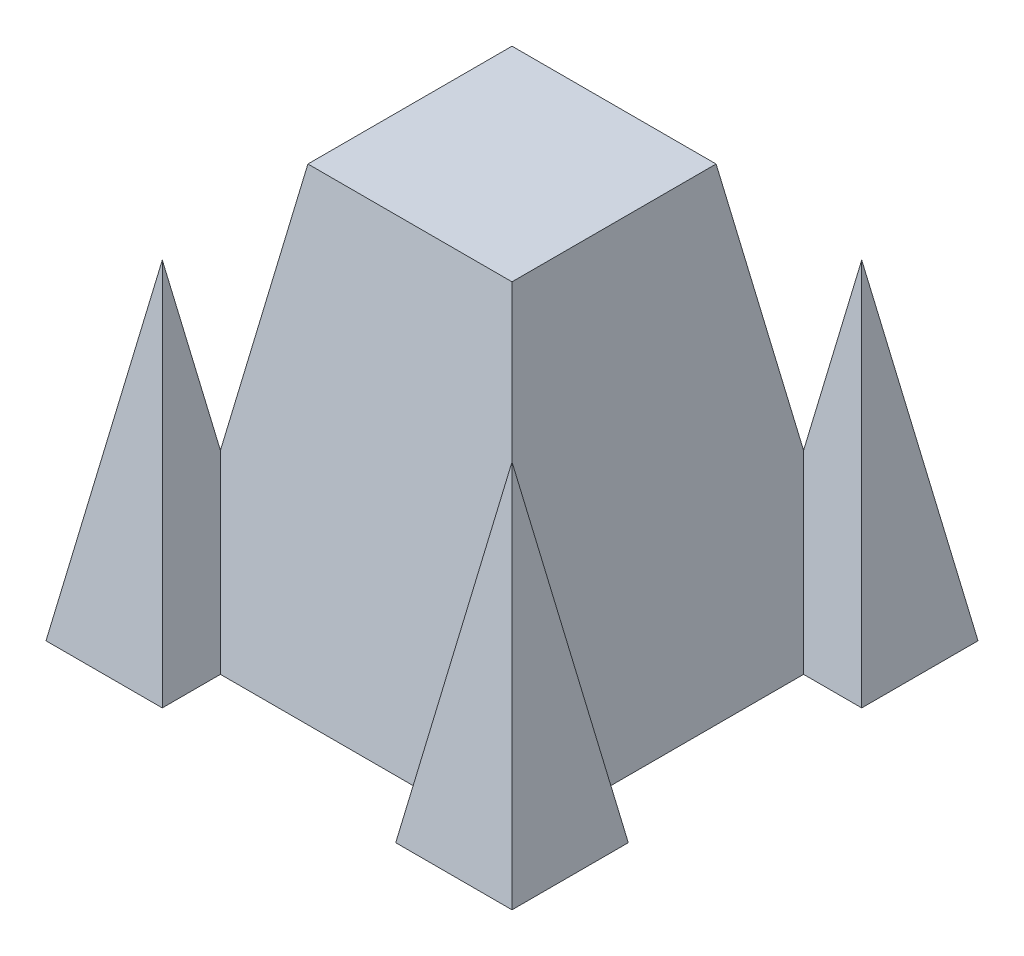
ISO-10303-21;
HEADER;
FILE_DESCRIPTION(('STEP AP214'),'2;1');
FILE_NAME('part.step','',(''),(''),'','','');
FILE_SCHEMA(('AUTOMOTIVE_DESIGN { 1 0 10303 214 1 1 1 1 }'));
ENDSEC;
DATA;
#1=APPLICATION_CONTEXT('core data for automotive mechanical design processes');
#2=APPLICATION_PROTOCOL_DEFINITION('international standard','automotive_design',2000,#1);
#3=PRODUCT_CONTEXT('',#1,'mechanical');
#4=PRODUCT('Part','Part','',(#3));
#5=PRODUCT_RELATED_PRODUCT_CATEGORY('part','',(#4));
#6=PRODUCT_DEFINITION_FORMATION('','',#4);
#7=PRODUCT_DEFINITION_CONTEXT('part definition',#1,'design');
#8=PRODUCT_DEFINITION('design','',#6,#7);
#9=PRODUCT_DEFINITION_SHAPE('','',#8);
#10=(LENGTH_UNIT() NAMED_UNIT(*) SI_UNIT(.MILLI.,.METRE.));
#11=(NAMED_UNIT(*) PLANE_ANGLE_UNIT() SI_UNIT($,.RADIAN.));
#12=(NAMED_UNIT(*) SI_UNIT($,.STERADIAN.) SOLID_ANGLE_UNIT());
#13=UNCERTAINTY_MEASURE_WITH_UNIT(LENGTH_MEASURE(1.E-05),#10,'distance_accuracy_value','');
#14=(GEOMETRIC_REPRESENTATION_CONTEXT(3) GLOBAL_UNCERTAINTY_ASSIGNED_CONTEXT((#13)) GLOBAL_UNIT_ASSIGNED_CONTEXT((#10,
#11,#12)) REPRESENTATION_CONTEXT('',''));
#15=CARTESIAN_POINT('',(0.,0.,0.));
#16=DIRECTION('',(0.,0.,1.));
#17=DIRECTION('',(1.,0.,0.));
#18=AXIS2_PLACEMENT_3D('',#15,#16,#17);
#19=CARTESIAN_POINT('',(29.6786730722033,0.,59.2470630383818));
#20=DIRECTION('',(-0.984807753012208,0.173648177666931,0.));
#21=DIRECTION('',(-0.173648177666931,-0.984807753012208,0.));
#22=AXIS2_PLACEMENT_3D('',#19,#20,#21);
#23=PLANE('',#22);
#24=DIRECTION('',(-0.171087869746036,-0.970287525247814,0.171087869746036));
#25=VECTOR('',#24,1.);
#26=CARTESIAN_POINT('',(30.5441711645902,4.90848359626769,58.3815649459949));
#27=LINE('',#26,#25);
#28=CARTESIAN_POINT('',(44.4628680552925,83.8453362252772,44.4628680552926));
#29=VERTEX_POINT('',#28);
#30=CARTESIAN_POINT('',(29.6786730722033,0.,59.2470630383818));
#31=VERTEX_POINT('',#30);
#32=EDGE_CURVE('E257',#29,#31,#27,.T.);
#33=ORIENTED_EDGE('',*,*,#32,.F.);
#34=DIRECTION('',(-0.171087869746036,-0.970287525247814,-0.171087869746036));
#35=VECTOR('',#34,1.);
#36=CARTESIAN_POINT('',(30.5441711645902,4.9084835962677,30.5441711645902));
#37=LINE('',#36,#35);
#38=CARTESIAN_POINT('',(37.0707705637479,41.9226681126385,37.0707705637479));
#39=VERTEX_POINT('',#38);
#40=EDGE_CURVE('E325',#29,#39,#37,.T.);
#41=ORIENTED_EDGE('',*,*,#40,.T.);
#42=DIRECTION('',(-0.171087869746036,-0.970287525247814,0.171087869746036));
#43=VECTOR('',#42,1.);
#44=CARTESIAN_POINT('',(27.9412206807847,-9.8535821599034,46.2003204467111));
#45=LINE('',#44,#43);
#46=CARTESIAN_POINT('',(29.6786730722033,0.,44.4628680552925));
#47=VERTEX_POINT('',#46);
#48=EDGE_CURVE('E261',#39,#47,#45,.T.);
#49=ORIENTED_EDGE('',*,*,#48,.T.);
#50=DIRECTION('',(0.,0.,1.));
#51=VECTOR('',#50,1.);
#52=CARTESIAN_POINT('',(29.6786730722033,0.,59.2470630383818));
#53=LINE('',#52,#51);
#54=EDGE_CURVE('E199',#47,#31,#53,.T.);
#55=ORIENTED_EDGE('',*,*,#54,.T.);
#56=EDGE_LOOP('',(#33,#41,#49,#55));
#57=FACE_BOUND('',#56,.T.);
#58=ADVANCED_FACE('F33',(#57),#23,.T.);
#59=CARTESIAN_POINT('',(59.2470630383818,0.,59.2470630383818));
#60=DIRECTION('',(0.,0.173648177666931,0.984807753012208));
#61=DIRECTION('',(0.,-0.984807753012208,0.173648177666931));
#62=AXIS2_PLACEMENT_3D('',#59,#60,#61);
#63=PLANE('',#62);
#64=DIRECTION('',(1.,0.,0.));
#65=VECTOR('',#64,1.);
#66=CARTESIAN_POINT('',(59.2470630383818,0.,59.2470630383818));
#67=LINE('',#66,#65);
#68=CARTESIAN_POINT('',(59.2470630383818,0.,59.2470630383818));
#69=VERTEX_POINT('',#68);
#70=EDGE_CURVE('E202',#31,#69,#67,.T.);
#71=ORIENTED_EDGE('',*,*,#70,.T.);
#72=DIRECTION('',(0.171087869746036,-0.970287525247814,0.171087869746036));
#73=VECTOR('',#72,1.);
#74=CARTESIAN_POINT('',(59.2470630383818,0.,59.2470630383818));
#75=LINE('',#74,#73);
#76=EDGE_CURVE('E260',#29,#69,#75,.T.);
#77=ORIENTED_EDGE('',*,*,#76,.F.);
#78=ORIENTED_EDGE('',*,*,#32,.T.);
#79=EDGE_LOOP('',(#71,#77,#78));
#80=FACE_BOUND('',#79,.T.);
#81=ADVANCED_FACE('F35',(#80),#63,.T.);
#82=CARTESIAN_POINT('',(59.2470630383818,0.,59.2470630383818));
#83=DIRECTION('',(0.984807753012208,0.173648177666931,0.));
#84=DIRECTION('',(-0.173648177666931,0.984807753012208,0.));
#85=AXIS2_PLACEMENT_3D('',#82,#83,#84);
#86=PLANE('',#85);
#87=DIRECTION('',(0.,0.,-1.));
#88=VECTOR('',#87,1.);
#89=CARTESIAN_POINT('',(59.2470630383818,0.,59.2470630383818));
#90=LINE('',#89,#88);
#91=CARTESIAN_POINT('',(59.2470630383818,0.,29.6786730722033));
#92=VERTEX_POINT('',#91);
#93=EDGE_CURVE('E205',#69,#92,#90,.T.);
#94=ORIENTED_EDGE('',*,*,#93,.T.);
#95=DIRECTION('',(0.171087869746036,-0.970287525247814,-0.171087869746036));
#96=VECTOR('',#95,1.);
#97=CARTESIAN_POINT('',(59.2470630383818,0.,29.6786730722033));
#98=LINE('',#97,#96);
#99=EDGE_CURVE('E299',#29,#92,#98,.T.);
#100=ORIENTED_EDGE('',*,*,#99,.F.);
#101=ORIENTED_EDGE('',*,*,#76,.T.);
#102=EDGE_LOOP('',(#94,#100,#101));
#103=FACE_BOUND('',#102,.T.);
#104=ADVANCED_FACE('F409',(#103),#86,.T.);
#105=CARTESIAN_POINT('',(59.2470630383818,0.,29.6786730722033));
#106=DIRECTION('',(0.,0.173648177666931,-0.984807753012208));
#107=DIRECTION('',(0.,0.984807753012208,0.173648177666931));
#108=AXIS2_PLACEMENT_3D('',#105,#106,#107);
#109=PLANE('',#108);
#110=ORIENTED_EDGE('',*,*,#40,.F.);
#111=ORIENTED_EDGE('',*,*,#99,.T.);
#112=DIRECTION('',(-1.,0.,0.));
#113=VECTOR('',#112,1.);
#114=CARTESIAN_POINT('',(59.2470630383818,0.,29.6786730722033));
#115=LINE('',#114,#113);
#116=CARTESIAN_POINT('',(44.4628680552925,0.,29.6786730722033));
#117=VERTEX_POINT('',#116);
#118=EDGE_CURVE('E207',#92,#117,#115,.T.);
#119=ORIENTED_EDGE('',*,*,#118,.T.);
#120=DIRECTION('',(0.171087869746036,-0.970287525247814,-0.171087869746036));
#121=VECTOR('',#120,1.);
#122=CARTESIAN_POINT('',(44.895617101486,-2.45424179813385,29.2459240260098));
#123=LINE('',#122,#121);
#124=EDGE_CURVE('E297',#39,#117,#123,.T.);
#125=ORIENTED_EDGE('',*,*,#124,.F.);
#126=EDGE_LOOP('',(#110,#111,#119,#125));
#127=FACE_BOUND('',#126,.T.);
#128=ADVANCED_FACE('F404',(#127),#109,.T.);
#129=CARTESIAN_POINT('',(44.4628680552925,0.,-29.6786730722032));
#130=DIRECTION('',(0.984807753012208,0.173648177666931,0.));
#131=DIRECTION('',(-0.173648177666931,0.984807753012208,0.));
#132=AXIS2_PLACEMENT_3D('',#129,#130,#131);
#133=PLANE('',#132);
#134=DIRECTION('',(0.,0.,1.));
#135=VECTOR('',#134,1.);
#136=CARTESIAN_POINT('',(25.9485350809036,105.,0.));
#137=LINE('',#136,#135);
#138=CARTESIAN_POINT('',(25.9485350809036,105.,25.9485350809037));
#139=VERTEX_POINT('',#138);
#140=CARTESIAN_POINT('',(25.9485350809036,105.,-25.9485350809037));
#141=VERTEX_POINT('',#140);
#142=EDGE_CURVE('E256',#139,#141,#137,.F.);
#143=ORIENTED_EDGE('',*,*,#142,.F.);
#144=DIRECTION('',(0.171087869746036,-0.970287525247814,0.171087869746036));
#145=VECTOR('',#144,1.);
#146=CARTESIAN_POINT('',(42.2926666176805,12.3078239580372,42.2926666176805));
#147=LINE('',#146,#145);
#148=EDGE_CURVE('E315',#139,#39,#147,.T.);
#149=ORIENTED_EDGE('',*,*,#148,.T.);
#150=ORIENTED_EDGE('',*,*,#124,.T.);
#151=DIRECTION('',(0.,0.,-1.));
#152=VECTOR('',#151,1.);
#153=CARTESIAN_POINT('',(44.4628680552925,0.,-29.6786730722032));
#154=LINE('',#153,#152);
#155=CARTESIAN_POINT('',(44.4628680552925,0.,-29.6786730722032));
#156=VERTEX_POINT('',#155);
#157=EDGE_CURVE('E210',#117,#156,#154,.T.);
#158=ORIENTED_EDGE('',*,*,#157,.T.);
#159=DIRECTION('',(0.171087869746036,-0.970287525247814,0.171087869746036));
#160=VECTOR('',#159,1.);
#161=CARTESIAN_POINT('',(44.4628680552925,0.,-29.6786730722032));
#162=LINE('',#161,#160);
#163=CARTESIAN_POINT('',(37.0707705637479,41.9226681126386,-37.0707705637479));
#164=VERTEX_POINT('',#163);
#165=EDGE_CURVE('E295',#164,#156,#162,.T.);
#166=ORIENTED_EDGE('',*,*,#165,.F.);
#167=DIRECTION('',(0.171087869746036,-0.970287525247814,-0.171087869746036));
#168=VECTOR('',#167,1.);
#169=CARTESIAN_POINT('',(42.2926666176805,12.3078239580372,-42.2926666176805));
#170=LINE('',#169,#168);
#171=EDGE_CURVE('E259',#141,#164,#170,.T.);
#172=ORIENTED_EDGE('',*,*,#171,.F.);
#173=EDGE_LOOP('',(#143,#149,#150,#158,#166,#172));
#174=FACE_BOUND('',#173,.T.);
#175=ADVANCED_FACE('F401',(#174),#133,.T.);
#176=CARTESIAN_POINT('',(59.2470630383817,0.,-29.6786730722032));
#177=DIRECTION('',(0.,0.173648177666931,0.984807753012208));
#178=DIRECTION('',(0.,-0.984807753012208,0.173648177666931));
#179=AXIS2_PLACEMENT_3D('',#176,#177,#178);
#180=PLANE('',#179);
#181=DIRECTION('',(0.171087869746036,-0.970287525247814,0.171087869746036));
#182=VECTOR('',#181,1.);
#183=CARTESIAN_POINT('',(58.3815649459948,4.90848359626769,-30.5441711645901));
#184=LINE('',#183,#182);
#185=CARTESIAN_POINT('',(44.4628680552925,83.8453362252771,-44.4628680552924));
#186=VERTEX_POINT('',#185);
#187=CARTESIAN_POINT('',(59.2470630383817,0.,-29.6786730722032));
#188=VERTEX_POINT('',#187);
#189=EDGE_CURVE('E293',#186,#188,#184,.T.);
#190=ORIENTED_EDGE('',*,*,#189,.F.);
#191=DIRECTION('',(-0.171087869746036,-0.970287525247814,0.171087869746036));
#192=VECTOR('',#191,1.);
#193=CARTESIAN_POINT('',(30.5441711645902,4.90848359626769,-30.5441711645901));
#194=LINE('',#193,#192);
#195=EDGE_CURVE('E323',#186,#164,#194,.T.);
#196=ORIENTED_EDGE('',*,*,#195,.T.);
#197=ORIENTED_EDGE('',*,*,#165,.T.);
#198=DIRECTION('',(1.,0.,0.));
#199=VECTOR('',#198,1.);
#200=CARTESIAN_POINT('',(59.2470630383817,0.,-29.6786730722032));
#201=LINE('',#200,#199);
#202=EDGE_CURVE('E213',#156,#188,#201,.T.);
#203=ORIENTED_EDGE('',*,*,#202,.T.);
#204=EDGE_LOOP('',(#190,#196,#197,#203));
#205=FACE_BOUND('',#204,.T.);
#206=ADVANCED_FACE('F398',(#205),#180,.T.);
#207=CARTESIAN_POINT('',(59.2470630383817,0.,-59.2470630383817));
#208=DIRECTION('',(0.984807753012208,0.173648177666931,0.));
#209=DIRECTION('',(-0.173648177666931,0.984807753012208,0.));
#210=AXIS2_PLACEMENT_3D('',#207,#208,#209);
#211=PLANE('',#210);
#212=DIRECTION('',(0.,0.,-1.));
#213=VECTOR('',#212,1.);
#214=CARTESIAN_POINT('',(59.2470630383817,0.,-59.2470630383817));
#215=LINE('',#214,#213);
#216=CARTESIAN_POINT('',(59.2470630383817,0.,-59.2470630383817));
#217=VERTEX_POINT('',#216);
#218=EDGE_CURVE('E216',#188,#217,#215,.T.);
#219=ORIENTED_EDGE('',*,*,#218,.T.);
#220=DIRECTION('',(0.171087869746036,-0.970287525247814,-0.171087869746036));
#221=VECTOR('',#220,1.);
#222=CARTESIAN_POINT('',(59.2470630383817,0.,-59.2470630383817));
#223=LINE('',#222,#221);
#224=EDGE_CURVE('E291',#186,#217,#223,.T.);
#225=ORIENTED_EDGE('',*,*,#224,.F.);
#226=ORIENTED_EDGE('',*,*,#189,.T.);
#227=EDGE_LOOP('',(#219,#225,#226));
#228=FACE_BOUND('',#227,.T.);
#229=ADVANCED_FACE('F393',(#228),#211,.T.);
#230=CARTESIAN_POINT('',(59.2470630383817,0.,-59.2470630383817));
#231=DIRECTION('',(0.,0.173648177666931,-0.984807753012208));
#232=DIRECTION('',(0.,0.984807753012208,0.173648177666931));
#233=AXIS2_PLACEMENT_3D('',#230,#231,#232);
#234=PLANE('',#233);
#235=DIRECTION('',(-1.,0.,0.));
#236=VECTOR('',#235,1.);
#237=CARTESIAN_POINT('',(59.2470630383817,0.,-59.2470630383817));
#238=LINE('',#237,#236);
#239=CARTESIAN_POINT('',(29.6786730722032,0.,-59.2470630383817));
#240=VERTEX_POINT('',#239);
#241=EDGE_CURVE('E219',#217,#240,#238,.T.);
#242=ORIENTED_EDGE('',*,*,#241,.T.);
#243=DIRECTION('',(-0.171087869746036,-0.970287525247814,-0.171087869746036));
#244=VECTOR('',#243,1.);
#245=CARTESIAN_POINT('',(29.6786730722032,0.,-59.2470630383817));
#246=LINE('',#245,#244);
#247=EDGE_CURVE('E288',#186,#240,#246,.T.);
#248=ORIENTED_EDGE('',*,*,#247,.F.);
#249=ORIENTED_EDGE('',*,*,#224,.T.);
#250=EDGE_LOOP('',(#242,#248,#249));
#251=FACE_BOUND('',#250,.T.);
#252=ADVANCED_FACE('F390',(#251),#234,.T.);
#253=CARTESIAN_POINT('',(29.6786730722032,0.,-59.2470630383817));
#254=DIRECTION('',(-0.984807753012208,0.173648177666931,0.));
#255=DIRECTION('',(-0.173648177666931,-0.984807753012208,0.));
#256=AXIS2_PLACEMENT_3D('',#253,#254,#255);
#257=PLANE('',#256);
#258=ORIENTED_EDGE('',*,*,#195,.F.);
#259=ORIENTED_EDGE('',*,*,#247,.T.);
#260=DIRECTION('',(0.,0.,1.));
#261=VECTOR('',#260,1.);
#262=CARTESIAN_POINT('',(29.6786730722032,0.,-59.2470630383817));
#263=LINE('',#262,#261);
#264=CARTESIAN_POINT('',(29.6786730722032,0.,-44.4628680552925));
#265=VERTEX_POINT('',#264);
#266=EDGE_CURVE('E221',#240,#265,#263,.T.);
#267=ORIENTED_EDGE('',*,*,#266,.T.);
#268=DIRECTION('',(-0.171087869746036,-0.970287525247814,-0.171087869746036));
#269=VECTOR('',#268,1.);
#270=CARTESIAN_POINT('',(29.2459240260098,-2.45424179813383,-44.895617101486));
#271=LINE('',#270,#269);
#272=EDGE_CURVE('E286',#164,#265,#271,.T.);
#273=ORIENTED_EDGE('',*,*,#272,.F.);
#274=EDGE_LOOP('',(#258,#259,#267,#273));
#275=FACE_BOUND('',#274,.T.);
#276=ADVANCED_FACE('F386',(#275),#257,.T.);
#277=CARTESIAN_POINT('',(-29.6786730722033,0.,-44.4628680552925));
#278=DIRECTION('',(0.,0.173648177666931,-0.984807753012208));
#279=DIRECTION('',(0.,0.984807753012208,0.173648177666931));
#280=AXIS2_PLACEMENT_3D('',#277,#278,#279);
#281=PLANE('',#280);
#282=DIRECTION('',(-0.171087869746036,-0.970287525247814,-0.171087869746036));
#283=VECTOR('',#282,1.);
#284=CARTESIAN_POINT('',(-44.0301190090991,2.45424179813385,-44.0301190090991));
#285=LINE('',#284,#283);
#286=CARTESIAN_POINT('',(-25.9485350809036,105.,-25.9485350809037));
#287=VERTEX_POINT('',#286);
#288=CARTESIAN_POINT('',(-37.0707705637479,41.9226681126386,-37.0707705637479));
#289=VERTEX_POINT('',#288);
#290=EDGE_CURVE('E318',#287,#289,#285,.T.);
#291=ORIENTED_EDGE('',*,*,#290,.F.);
#292=DIRECTION('',(1.,0.,0.));
#293=VECTOR('',#292,1.);
#294=CARTESIAN_POINT('',(0.,105.,-25.9485350809037));
#295=LINE('',#294,#293);
#296=EDGE_CURVE('E305',#141,#287,#295,.F.);
#297=ORIENTED_EDGE('',*,*,#296,.F.);
#298=ORIENTED_EDGE('',*,*,#171,.T.);
#299=ORIENTED_EDGE('',*,*,#272,.T.);
#300=DIRECTION('',(-1.,0.,0.));
#301=VECTOR('',#300,1.);
#302=CARTESIAN_POINT('',(-29.6786730722033,0.,-44.4628680552925));
#303=LINE('',#302,#301);
#304=CARTESIAN_POINT('',(-29.6786730722033,0.,-44.4628680552925));
#305=VERTEX_POINT('',#304);
#306=EDGE_CURVE('E224',#265,#305,#303,.T.);
#307=ORIENTED_EDGE('',*,*,#306,.T.);
#308=DIRECTION('',(0.171087869746036,-0.970287525247814,-0.171087869746036));
#309=VECTOR('',#308,1.);
#310=CARTESIAN_POINT('',(-29.6786730722033,0.,-44.4628680552925));
#311=LINE('',#310,#309);
#312=EDGE_CURVE('E284',#289,#305,#311,.T.);
#313=ORIENTED_EDGE('',*,*,#312,.F.);
#314=EDGE_LOOP('',(#291,#297,#298,#299,#307,#313));
#315=FACE_BOUND('',#314,.T.);
#316=ADVANCED_FACE('F363',(#315),#281,.T.);
#317=CARTESIAN_POINT('',(-29.6786730722033,0.,-59.2470630383818));
#318=DIRECTION('',(0.984807753012208,0.173648177666931,0.));
#319=DIRECTION('',(-0.173648177666931,0.984807753012208,0.));
#320=AXIS2_PLACEMENT_3D('',#317,#318,#319);
#321=PLANE('',#320);
#322=DIRECTION('',(0.171087869746036,-0.970287525247814,-0.171087869746036));
#323=VECTOR('',#322,1.);
#324=CARTESIAN_POINT('',(-30.5441711645902,4.90848359626769,-58.3815649459949));
#325=LINE('',#324,#323);
#326=CARTESIAN_POINT('',(-44.4628680552925,83.8453362252771,-44.4628680552925));
#327=VERTEX_POINT('',#326);
#328=CARTESIAN_POINT('',(-29.6786730722033,0.,-59.2470630383818));
#329=VERTEX_POINT('',#328);
#330=EDGE_CURVE('E282',#327,#329,#325,.T.);
#331=ORIENTED_EDGE('',*,*,#330,.F.);
#332=DIRECTION('',(0.171087869746036,-0.970287525247814,0.171087869746036));
#333=VECTOR('',#332,1.);
#334=CARTESIAN_POINT('',(-30.5441711645902,4.90848359626769,-30.5441711645902));
#335=LINE('',#334,#333);
#336=EDGE_CURVE('E327',#327,#289,#335,.T.);
#337=ORIENTED_EDGE('',*,*,#336,.T.);
#338=ORIENTED_EDGE('',*,*,#312,.T.);
#339=DIRECTION('',(0.,0.,-1.));
#340=VECTOR('',#339,1.);
#341=CARTESIAN_POINT('',(-29.6786730722033,0.,-59.2470630383818));
#342=LINE('',#341,#340);
#343=EDGE_CURVE('E227',#305,#329,#342,.T.);
#344=ORIENTED_EDGE('',*,*,#343,.T.);
#345=EDGE_LOOP('',(#331,#337,#338,#344));
#346=FACE_BOUND('',#345,.T.);
#347=ADVANCED_FACE('F380',(#346),#321,.T.);
#348=CARTESIAN_POINT('',(-59.2470630383818,0.,-59.2470630383818));
#349=DIRECTION('',(0.,0.173648177666931,-0.984807753012208));
#350=DIRECTION('',(0.,0.984807753012208,0.173648177666931));
#351=AXIS2_PLACEMENT_3D('',#348,#349,#350);
#352=PLANE('',#351);
#353=DIRECTION('',(-1.,0.,0.));
#354=VECTOR('',#353,1.);
#355=CARTESIAN_POINT('',(-59.2470630383818,0.,-59.2470630383818));
#356=LINE('',#355,#354);
#357=CARTESIAN_POINT('',(-59.2470630383818,0.,-59.2470630383818));
#358=VERTEX_POINT('',#357);
#359=EDGE_CURVE('E230',#329,#358,#356,.T.);
#360=ORIENTED_EDGE('',*,*,#359,.T.);
#361=DIRECTION('',(-0.171087869746036,-0.970287525247814,-0.171087869746036));
#362=VECTOR('',#361,1.);
#363=CARTESIAN_POINT('',(-59.2470630383818,0.,-59.2470630383818));
#364=LINE('',#363,#362);
#365=EDGE_CURVE('E280',#327,#358,#364,.T.);
#366=ORIENTED_EDGE('',*,*,#365,.F.);
#367=ORIENTED_EDGE('',*,*,#330,.T.);
#368=EDGE_LOOP('',(#360,#366,#367));
#369=FACE_BOUND('',#368,.T.);
#370=ADVANCED_FACE('F379',(#369),#352,.T.);
#371=CARTESIAN_POINT('',(-59.2470630383818,0.,-59.2470630383818));
#372=DIRECTION('',(-0.984807753012208,0.173648177666931,0.));
#373=DIRECTION('',(-0.173648177666931,-0.984807753012208,0.));
#374=AXIS2_PLACEMENT_3D('',#371,#372,#373);
#375=PLANE('',#374);
#376=DIRECTION('',(0.,0.,1.));
#377=VECTOR('',#376,1.);
#378=CARTESIAN_POINT('',(-59.2470630383818,0.,-59.2470630383818));
#379=LINE('',#378,#377);
#380=CARTESIAN_POINT('',(-59.2470630383818,0.,-29.6786730722033));
#381=VERTEX_POINT('',#380);
#382=EDGE_CURVE('E233',#358,#381,#379,.T.);
#383=ORIENTED_EDGE('',*,*,#382,.T.);
#384=DIRECTION('',(-0.171087869746036,-0.970287525247814,0.171087869746036));
#385=VECTOR('',#384,1.);
#386=CARTESIAN_POINT('',(-59.2470630383818,0.,-29.6786730722033));
#387=LINE('',#386,#385);
#388=EDGE_CURVE('E277',#327,#381,#387,.T.);
#389=ORIENTED_EDGE('',*,*,#388,.F.);
#390=ORIENTED_EDGE('',*,*,#365,.T.);
#391=EDGE_LOOP('',(#383,#389,#390));
#392=FACE_BOUND('',#391,.T.);
#393=ADVANCED_FACE('F376',(#392),#375,.T.);
#394=CARTESIAN_POINT('',(-59.2470630383818,0.,-29.6786730722033));
#395=DIRECTION('',(0.,0.173648177666931,0.984807753012208));
#396=DIRECTION('',(0.,-0.984807753012208,0.173648177666931));
#397=AXIS2_PLACEMENT_3D('',#394,#395,#396);
#398=PLANE('',#397);
#399=ORIENTED_EDGE('',*,*,#336,.F.);
#400=ORIENTED_EDGE('',*,*,#388,.T.);
#401=DIRECTION('',(1.,0.,0.));
#402=VECTOR('',#401,1.);
#403=CARTESIAN_POINT('',(-59.2470630383818,0.,-29.6786730722033));
#404=LINE('',#403,#402);
#405=CARTESIAN_POINT('',(-44.4628680552925,0.,-29.6786730722033));
#406=VERTEX_POINT('',#405);
#407=EDGE_CURVE('E235',#381,#406,#404,.T.);
#408=ORIENTED_EDGE('',*,*,#407,.T.);
#409=DIRECTION('',(-0.171087869746036,-0.970287525247814,0.171087869746036));
#410=VECTOR('',#409,1.);
#411=CARTESIAN_POINT('',(-44.895617101486,-2.45424179813384,-29.2459240260098));
#412=LINE('',#411,#410);
#413=EDGE_CURVE('E275',#289,#406,#412,.T.);
#414=ORIENTED_EDGE('',*,*,#413,.F.);
#415=EDGE_LOOP('',(#399,#400,#408,#414));
#416=FACE_BOUND('',#415,.T.);
#417=ADVANCED_FACE('F368',(#416),#398,.T.);
#418=CARTESIAN_POINT('',(-44.4628680552925,0.,-29.6786730722033));
#419=DIRECTION('',(-0.984807753012208,0.173648177666931,0.));
#420=DIRECTION('',(-0.173648177666931,-0.984807753012208,0.));
#421=AXIS2_PLACEMENT_3D('',#418,#419,#420);
#422=PLANE('',#421);
#423=DIRECTION('',(0.,0.,1.));
#424=VECTOR('',#423,1.);
#425=CARTESIAN_POINT('',(-44.4628680552925,0.,-29.6786730722033));
#426=LINE('',#425,#424);
#427=CARTESIAN_POINT('',(-44.4628680552925,0.,-12.3414810434325));
#428=VERTEX_POINT('',#427);
#429=EDGE_CURVE('E239',#406,#428,#426,.T.);
#430=ORIENTED_EDGE('',*,*,#429,.T.);
#431=DIRECTION('',(-0.173648177666931,-0.984807753012208,0.));
#432=VECTOR('',#431,1.);
#433=CARTESIAN_POINT('',(-44.4628680552925,0.,-12.3414810434325));
#434=LINE('',#433,#432);
#435=CARTESIAN_POINT('',(-38.4105565367998,34.3243642814902,-12.3414810434325));
#436=VERTEX_POINT('',#435);
#437=EDGE_CURVE('E197',#428,#436,#434,.F.);
#438=ORIENTED_EDGE('',*,*,#437,.T.);
#439=DIRECTION('',(0.,0.,-1.));
#440=VECTOR('',#439,1.);
#441=CARTESIAN_POINT('',(-38.4105565367998,34.3243642814902,-29.6786730722033));
#442=LINE('',#441,#440);
#443=CARTESIAN_POINT('',(-38.4105565367998,34.3243642814902,12.3414810434326));
#444=VERTEX_POINT('',#443);
#445=EDGE_CURVE('E11',#436,#444,#442,.F.);
#446=ORIENTED_EDGE('',*,*,#445,.T.);
#447=DIRECTION('',(0.173648177666931,0.984807753012208,0.));
#448=VECTOR('',#447,1.);
#449=CARTESIAN_POINT('',(-44.4628680552925,0.,12.3414810434325));
#450=LINE('',#449,#448);
#451=CARTESIAN_POINT('',(-44.4628680552925,0.,12.3414810434325));
#452=VERTEX_POINT('',#451);
#453=EDGE_CURVE('E193',#444,#452,#450,.F.);
#454=ORIENTED_EDGE('',*,*,#453,.T.);
#455=CARTESIAN_POINT('',(-44.4628680552925,0.,29.6786730722033));
#456=VERTEX_POINT('',#455);
#457=EDGE_CURVE('E238',#452,#456,#426,.T.);
#458=ORIENTED_EDGE('',*,*,#457,.T.);
#459=DIRECTION('',(-0.171087869746036,-0.970287525247814,-0.171087869746036));
#460=VECTOR('',#459,1.);
#461=CARTESIAN_POINT('',(-46.2003204467111,-9.85358215990341,27.9412206807847));
#462=LINE('',#461,#460);
#463=CARTESIAN_POINT('',(-37.0707705637479,41.9226681126385,37.0707705637479));
#464=VERTEX_POINT('',#463);
#465=EDGE_CURVE('E273',#464,#456,#462,.T.);
#466=ORIENTED_EDGE('',*,*,#465,.F.);
#467=DIRECTION('',(-0.171087869746036,-0.970287525247814,0.171087869746036));
#468=VECTOR('',#467,1.);
#469=CARTESIAN_POINT('',(-44.030119009099,2.45424179813384,44.0301190090991));
#470=LINE('',#469,#468);
#471=CARTESIAN_POINT('',(-25.9485350809036,105.,25.9485350809037));
#472=VERTEX_POINT('',#471);
#473=EDGE_CURVE('E321',#472,#464,#470,.T.);
#474=ORIENTED_EDGE('',*,*,#473,.F.);
#475=DIRECTION('',(0.,0.,-1.));
#476=VECTOR('',#475,1.);
#477=CARTESIAN_POINT('',(-25.9485350809036,105.,0.));
#478=LINE('',#477,#476);
#479=EDGE_CURVE('E308',#287,#472,#478,.F.);
#480=ORIENTED_EDGE('',*,*,#479,.F.);
#481=ORIENTED_EDGE('',*,*,#290,.T.);
#482=ORIENTED_EDGE('',*,*,#413,.T.);
#483=EDGE_LOOP('',(#430,#438,#446,#454,#458,#466,#474,#480,#481,#482));
#484=FACE_BOUND('',#483,.T.);
#485=ADVANCED_FACE('F337',(#484),#422,.T.);
#486=CARTESIAN_POINT('',(-59.2470630383817,0.,29.6786730722033));
#487=DIRECTION('',(0.,0.173648177666931,-0.984807753012208));
#488=DIRECTION('',(0.,0.984807753012208,0.173648177666931));
#489=AXIS2_PLACEMENT_3D('',#486,#487,#488);
#490=PLANE('',#489);
#491=DIRECTION('',(-0.171087869746036,-0.970287525247814,-0.171087869746036));
#492=VECTOR('',#491,1.);
#493=CARTESIAN_POINT('',(-58.3815649459948,4.90848359626769,30.5441711645902));
#494=LINE('',#493,#492);
#495=CARTESIAN_POINT('',(-44.4628680552925,83.8453362252772,44.4628680552925));
#496=VERTEX_POINT('',#495);
#497=CARTESIAN_POINT('',(-59.2470630383817,0.,29.6786730722033));
#498=VERTEX_POINT('',#497);
#499=EDGE_CURVE('E271',#496,#498,#494,.T.);
#500=ORIENTED_EDGE('',*,*,#499,.F.);
#501=DIRECTION('',(0.171087869746036,-0.970287525247814,-0.171087869746036));
#502=VECTOR('',#501,1.);
#503=CARTESIAN_POINT('',(-30.5441711645902,4.90848359626769,30.5441711645902));
#504=LINE('',#503,#502);
#505=EDGE_CURVE('E56',#496,#464,#504,.T.);
#506=ORIENTED_EDGE('',*,*,#505,.T.);
#507=ORIENTED_EDGE('',*,*,#465,.T.);
#508=DIRECTION('',(-1.,0.,0.));
#509=VECTOR('',#508,1.);
#510=CARTESIAN_POINT('',(-59.2470630383817,0.,29.6786730722033));
#511=LINE('',#510,#509);
#512=EDGE_CURVE('E242',#456,#498,#511,.T.);
#513=ORIENTED_EDGE('',*,*,#512,.T.);
#514=EDGE_LOOP('',(#500,#506,#507,#513));
#515=FACE_BOUND('',#514,.T.);
#516=ADVANCED_FACE('F343',(#515),#490,.T.);
#517=CARTESIAN_POINT('',(-59.2470630383817,0.,59.2470630383818));
#518=DIRECTION('',(-0.984807753012208,0.173648177666931,0.));
#519=DIRECTION('',(-0.173648177666931,-0.984807753012208,0.));
#520=AXIS2_PLACEMENT_3D('',#517,#518,#519);
#521=PLANE('',#520);
#522=DIRECTION('',(0.,0.,1.));
#523=VECTOR('',#522,1.);
#524=CARTESIAN_POINT('',(-59.2470630383817,0.,59.2470630383818));
#525=LINE('',#524,#523);
#526=CARTESIAN_POINT('',(-59.2470630383817,0.,59.2470630383818));
#527=VERTEX_POINT('',#526);
#528=EDGE_CURVE('E245',#498,#527,#525,.T.);
#529=ORIENTED_EDGE('',*,*,#528,.T.);
#530=DIRECTION('',(-0.171087869746036,-0.970287525247814,0.171087869746036));
#531=VECTOR('',#530,1.);
#532=CARTESIAN_POINT('',(-59.2470630383817,0.,59.2470630383818));
#533=LINE('',#532,#531);
#534=EDGE_CURVE('E269',#496,#527,#533,.T.);
#535=ORIENTED_EDGE('',*,*,#534,.F.);
#536=ORIENTED_EDGE('',*,*,#499,.T.);
#537=EDGE_LOOP('',(#529,#535,#536));
#538=FACE_BOUND('',#537,.T.);
#539=ADVANCED_FACE('F418',(#538),#521,.T.);
#540=CARTESIAN_POINT('',(-59.2470630383817,0.,59.2470630383818));
#541=DIRECTION('',(0.,0.173648177666931,0.984807753012208));
#542=DIRECTION('',(0.,-0.984807753012208,0.173648177666931));
#543=AXIS2_PLACEMENT_3D('',#540,#541,#542);
#544=PLANE('',#543);
#545=DIRECTION('',(1.,0.,0.));
#546=VECTOR('',#545,1.);
#547=CARTESIAN_POINT('',(-59.2470630383817,0.,59.2470630383818));
#548=LINE('',#547,#546);
#549=CARTESIAN_POINT('',(-29.6786730722033,0.,59.2470630383818));
#550=VERTEX_POINT('',#549);
#551=EDGE_CURVE('E248',#527,#550,#548,.T.);
#552=ORIENTED_EDGE('',*,*,#551,.T.);
#553=DIRECTION('',(0.171087869746036,-0.970287525247814,0.171087869746036));
#554=VECTOR('',#553,1.);
#555=CARTESIAN_POINT('',(-29.6786730722033,0.,59.2470630383818));
#556=LINE('',#555,#554);
#557=EDGE_CURVE('E266',#496,#550,#556,.T.);
#558=ORIENTED_EDGE('',*,*,#557,.F.);
#559=ORIENTED_EDGE('',*,*,#534,.T.);
#560=EDGE_LOOP('',(#552,#558,#559));
#561=FACE_BOUND('',#560,.T.);
#562=ADVANCED_FACE('F416',(#561),#544,.T.);
#563=CARTESIAN_POINT('',(-29.6786730722033,0.,59.2470630383818));
#564=DIRECTION('',(0.984807753012208,0.173648177666931,0.));
#565=DIRECTION('',(-0.173648177666931,0.984807753012208,0.));
#566=AXIS2_PLACEMENT_3D('',#563,#564,#565);
#567=PLANE('',#566);
#568=ORIENTED_EDGE('',*,*,#505,.F.);
#569=ORIENTED_EDGE('',*,*,#557,.T.);
#570=DIRECTION('',(0.,0.,-1.));
#571=VECTOR('',#570,1.);
#572=CARTESIAN_POINT('',(-29.6786730722033,0.,59.2470630383818));
#573=LINE('',#572,#571);
#574=CARTESIAN_POINT('',(-29.6786730722033,0.,44.4628680552925));
#575=VERTEX_POINT('',#574);
#576=EDGE_CURVE('E250',#550,#575,#573,.T.);
#577=ORIENTED_EDGE('',*,*,#576,.T.);
#578=DIRECTION('',(0.171087869746036,-0.970287525247814,0.171087869746036));
#579=VECTOR('',#578,1.);
#580=CARTESIAN_POINT('',(-29.2459240260098,-2.45424179813385,44.895617101486));
#581=LINE('',#580,#579);
#582=EDGE_CURVE('E263',#464,#575,#581,.T.);
#583=ORIENTED_EDGE('',*,*,#582,.F.);
#584=EDGE_LOOP('',(#568,#569,#577,#583));
#585=FACE_BOUND('',#584,.T.);
#586=ADVANCED_FACE('F348',(#585),#567,.T.);
#587=CARTESIAN_POINT('',(-29.6786730722033,0.,44.4628680552925));
#588=DIRECTION('',(0.,0.173648177666931,0.984807753012208));
#589=DIRECTION('',(0.,-0.984807753012208,0.173648177666931));
#590=AXIS2_PLACEMENT_3D('',#587,#588,#589);
#591=PLANE('',#590);
#592=DIRECTION('',(-1.,0.,0.));
#593=VECTOR('',#592,1.);
#594=CARTESIAN_POINT('',(0.,105.,25.9485350809037));
#595=LINE('',#594,#593);
#596=EDGE_CURVE('E264',#472,#139,#595,.F.);
#597=ORIENTED_EDGE('',*,*,#596,.F.);
#598=ORIENTED_EDGE('',*,*,#473,.T.);
#599=ORIENTED_EDGE('',*,*,#582,.T.);
#600=DIRECTION('',(1.,0.,0.));
#601=VECTOR('',#600,1.);
#602=CARTESIAN_POINT('',(-29.6786730722033,0.,44.4628680552925));
#603=LINE('',#602,#601);
#604=EDGE_CURVE('E253',#575,#47,#603,.T.);
#605=ORIENTED_EDGE('',*,*,#604,.T.);
#606=ORIENTED_EDGE('',*,*,#48,.F.);
#607=ORIENTED_EDGE('',*,*,#148,.F.);
#608=EDGE_LOOP('',(#597,#598,#599,#605,#606,#607));
#609=FACE_BOUND('',#608,.T.);
#610=ADVANCED_FACE('F353',(#609),#591,.T.);
#611=CARTESIAN_POINT('',(0.,105.,0.));
#612=DIRECTION('',(0.,-1.,0.));
#613=DIRECTION('',(0.,0.,-1.));
#614=AXIS2_PLACEMENT_3D('',#611,#612,#613);
#615=PLANE('',#614);
#616=ORIENTED_EDGE('',*,*,#596,.T.);
#617=ORIENTED_EDGE('',*,*,#142,.T.);
#618=ORIENTED_EDGE('',*,*,#296,.T.);
#619=ORIENTED_EDGE('',*,*,#479,.T.);
#620=EDGE_LOOP('',(#616,#617,#618,#619));
#621=FACE_BOUND('',#620,.T.);
#622=ADVANCED_FACE('F358',(#621),#615,.F.);
#623=CARTESIAN_POINT('',(0.,0.,0.));
#624=DIRECTION('',(0.,-1.,0.));
#625=DIRECTION('',(0.,0.,-1.));
#626=AXIS2_PLACEMENT_3D('',#623,#624,#625);
#627=PLANE('',#626);
#628=DIRECTION('',(1.,0.,0.));
#629=VECTOR('',#628,1.);
#630=CARTESIAN_POINT('',(0.,0.,-12.3414810434325));
#631=LINE('',#630,#629);
#632=CARTESIAN_POINT('',(0.,0.,-12.3414810434325));
#633=VERTEX_POINT('',#632);
#634=EDGE_CURVE('E41',#428,#633,#631,.T.);
#635=ORIENTED_EDGE('',*,*,#634,.F.);
#636=ORIENTED_EDGE('',*,*,#429,.F.);
#637=ORIENTED_EDGE('',*,*,#407,.F.);
#638=ORIENTED_EDGE('',*,*,#382,.F.);
#639=ORIENTED_EDGE('',*,*,#359,.F.);
#640=ORIENTED_EDGE('',*,*,#343,.F.);
#641=ORIENTED_EDGE('',*,*,#306,.F.);
#642=ORIENTED_EDGE('',*,*,#266,.F.);
#643=ORIENTED_EDGE('',*,*,#241,.F.);
#644=ORIENTED_EDGE('',*,*,#218,.F.);
#645=ORIENTED_EDGE('',*,*,#202,.F.);
#646=ORIENTED_EDGE('',*,*,#157,.F.);
#647=ORIENTED_EDGE('',*,*,#118,.F.);
#648=ORIENTED_EDGE('',*,*,#93,.F.);
#649=ORIENTED_EDGE('',*,*,#70,.F.);
#650=ORIENTED_EDGE('',*,*,#54,.F.);
#651=ORIENTED_EDGE('',*,*,#604,.F.);
#652=ORIENTED_EDGE('',*,*,#576,.F.);
#653=ORIENTED_EDGE('',*,*,#551,.F.);
#654=ORIENTED_EDGE('',*,*,#528,.F.);
#655=ORIENTED_EDGE('',*,*,#512,.F.);
#656=ORIENTED_EDGE('',*,*,#457,.F.);
#657=DIRECTION('',(-1.,0.,0.));
#658=VECTOR('',#657,1.);
#659=CARTESIAN_POINT('',(0.,0.,12.3414810434325));
#660=LINE('',#659,#658);
#661=CARTESIAN_POINT('',(0.,0.,12.3414810434325));
#662=VERTEX_POINT('',#661);
#663=EDGE_CURVE('E330',#662,#452,#660,.T.);
#664=ORIENTED_EDGE('',*,*,#663,.F.);
#665=DIRECTION('',(0.,0.,-1.));
#666=VECTOR('',#665,1.);
#667=CARTESIAN_POINT('',(0.,0.,-12.3414810434325));
#668=LINE('',#667,#666);
#669=EDGE_CURVE('E180',#662,#633,#668,.T.);
#670=ORIENTED_EDGE('',*,*,#669,.T.);
#671=EDGE_LOOP('',(#635,#636,#637,#638,#639,#640,#641,#642,#643,#644,#645,#646,#647,#648,#649,
#650,#651,#652,#653,#654,#655,#656,#664,#670));
#672=FACE_BOUND('',#671,.T.);
#673=ADVANCED_FACE('F340',(#672),#627,.T.);
#674=CARTESIAN_POINT('',(-105.,34.3243642814902,-12.3414810434325));
#675=DIRECTION('',(0.,1.,0.));
#676=DIRECTION('',(0.,0.,1.));
#677=AXIS2_PLACEMENT_3D('',#674,#675,#676);
#678=PLANE('',#677);
#679=DIRECTION('',(1.,0.,0.));
#680=VECTOR('',#679,1.);
#681=CARTESIAN_POINT('',(-105.,34.3243642814902,-12.3414810434325));
#682=LINE('',#681,#680);
#683=CARTESIAN_POINT('',(0.,34.3243642814902,-12.3414810434325));
#684=VERTEX_POINT('',#683);
#685=EDGE_CURVE('E173',#436,#684,#682,.T.);
#686=ORIENTED_EDGE('',*,*,#685,.T.);
#687=DIRECTION('',(0.,0.,1.));
#688=VECTOR('',#687,1.);
#689=CARTESIAN_POINT('',(0.,34.3243642814902,-12.3414810434325));
#690=LINE('',#689,#688);
#691=CARTESIAN_POINT('',(0.,34.3243642814902,12.3414810434326));
#692=VERTEX_POINT('',#691);
#693=EDGE_CURVE('E176',#684,#692,#690,.T.);
#694=ORIENTED_EDGE('',*,*,#693,.T.);
#695=DIRECTION('',(1.,0.,0.));
#696=VECTOR('',#695,1.);
#697=CARTESIAN_POINT('',(-105.,34.3243642814902,12.3414810434326));
#698=LINE('',#697,#696);
#699=EDGE_CURVE('E179',#444,#692,#698,.T.);
#700=ORIENTED_EDGE('',*,*,#699,.F.);
#701=ORIENTED_EDGE('',*,*,#445,.F.);
#702=EDGE_LOOP('',(#686,#694,#700,#701));
#703=FACE_BOUND('',#702,.T.);
#704=ADVANCED_FACE('F174',(#703),#678,.F.);
#705=CARTESIAN_POINT('',(-105.,0.,-12.3414810434325));
#706=DIRECTION('',(0.,0.,-1.));
#707=DIRECTION('',(-1.,0.,0.));
#708=AXIS2_PLACEMENT_3D('',#705,#706,#707);
#709=PLANE('',#708);
#710=ORIENTED_EDGE('',*,*,#634,.T.);
#711=DIRECTION('',(0.,1.,0.));
#712=VECTOR('',#711,1.);
#713=CARTESIAN_POINT('',(0.,0.,-12.3414810434325));
#714=LINE('',#713,#712);
#715=EDGE_CURVE('E48',#633,#684,#714,.T.);
#716=ORIENTED_EDGE('',*,*,#715,.T.);
#717=ORIENTED_EDGE('',*,*,#685,.F.);
#718=ORIENTED_EDGE('',*,*,#437,.F.);
#719=EDGE_LOOP('',(#710,#716,#717,#718));
#720=FACE_BOUND('',#719,.T.);
#721=ADVANCED_FACE('F186',(#720),#709,.F.);
#722=CARTESIAN_POINT('',(-105.,0.,12.3414810434325));
#723=DIRECTION('',(0.,0.,1.));
#724=DIRECTION('',(0.,-1.,0.));
#725=AXIS2_PLACEMENT_3D('',#722,#723,#724);
#726=PLANE('',#725);
#727=ORIENTED_EDGE('',*,*,#699,.T.);
#728=DIRECTION('',(0.,-1.,0.));
#729=VECTOR('',#728,1.);
#730=CARTESIAN_POINT('',(0.,0.,12.3414810434325));
#731=LINE('',#730,#729);
#732=EDGE_CURVE('E184',#692,#662,#731,.T.);
#733=ORIENTED_EDGE('',*,*,#732,.T.);
#734=ORIENTED_EDGE('',*,*,#663,.T.);
#735=ORIENTED_EDGE('',*,*,#453,.F.);
#736=EDGE_LOOP('',(#727,#733,#734,#735));
#737=FACE_BOUND('',#736,.T.);
#738=ADVANCED_FACE('F333',(#737),#726,.F.);
#739=CARTESIAN_POINT('',(0.,0.,0.));
#740=DIRECTION('',(1.,0.,0.));
#741=DIRECTION('',(0.,0.,-1.));
#742=AXIS2_PLACEMENT_3D('',#739,#740,#741);
#743=PLANE('',#742);
#744=ORIENTED_EDGE('',*,*,#715,.F.);
#745=ORIENTED_EDGE('',*,*,#669,.F.);
#746=ORIENTED_EDGE('',*,*,#732,.F.);
#747=ORIENTED_EDGE('',*,*,#693,.F.);
#748=EDGE_LOOP('',(#744,#745,#746,#747));
#749=FACE_BOUND('',#748,.T.);
#750=ADVANCED_FACE('F183',(#749),#743,.F.);
#751=CLOSED_SHELL('',(#58,#81,#104,#128,#175,#206,#229,#252,#276,#316,#347,#370,#393,#417,#485,
#516,#539,#562,#586,#610,#622,#673,#704,#721,#738,#750));
#752=MANIFOLD_SOLID_BREP('B2',#751);
#753=ADVANCED_BREP_SHAPE_REPRESENTATION('',(#18,#752),#14);
#754=SHAPE_DEFINITION_REPRESENTATION(#9,#753);
ENDSEC;
END-ISO-10303-21;
